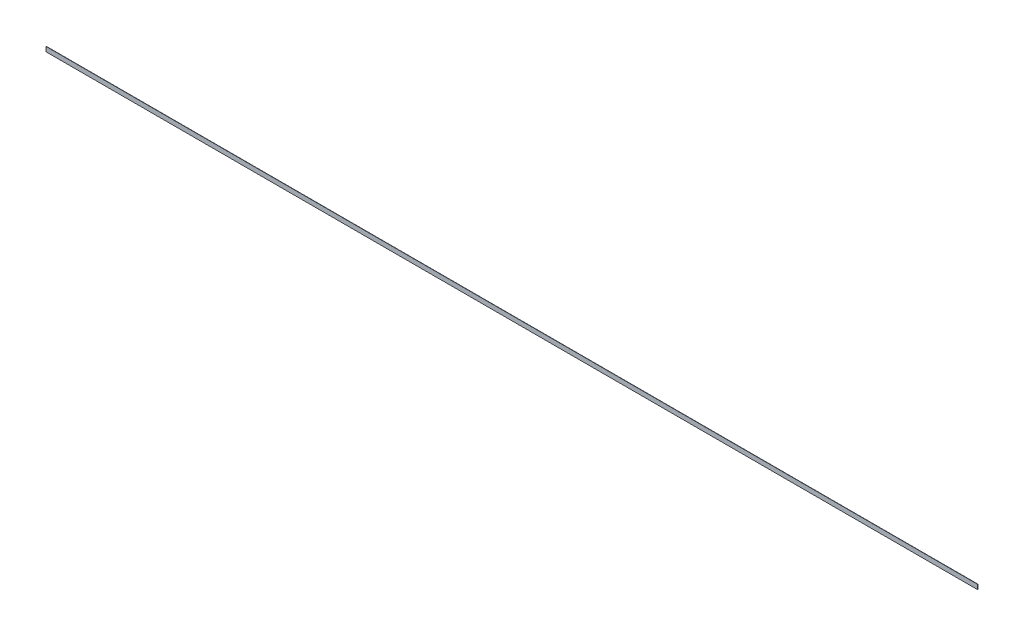
ISO-10303-21;
HEADER;
FILE_DESCRIPTION(('STEP AP214'),'2;1');
FILE_NAME('part.step','',(''),(''),'','','');
FILE_SCHEMA(('AUTOMOTIVE_DESIGN { 1 0 10303 214 1 1 1 1 }'));
ENDSEC;
DATA;
#1=APPLICATION_CONTEXT('core data for automotive mechanical design processes');
#2=APPLICATION_PROTOCOL_DEFINITION('international standard','automotive_design',2000,#1);
#3=PRODUCT_CONTEXT('',#1,'mechanical');
#4=PRODUCT('Part','Part','',(#3));
#5=PRODUCT_RELATED_PRODUCT_CATEGORY('part','',(#4));
#6=PRODUCT_DEFINITION_FORMATION('','',#4);
#7=PRODUCT_DEFINITION_CONTEXT('part definition',#1,'design');
#8=PRODUCT_DEFINITION('design','',#6,#7);
#9=PRODUCT_DEFINITION_SHAPE('','',#8);
#10=(LENGTH_UNIT() NAMED_UNIT(*) SI_UNIT(.MILLI.,.METRE.));
#11=(NAMED_UNIT(*) PLANE_ANGLE_UNIT() SI_UNIT($,.RADIAN.));
#12=(NAMED_UNIT(*) SI_UNIT($,.STERADIAN.) SOLID_ANGLE_UNIT());
#13=UNCERTAINTY_MEASURE_WITH_UNIT(LENGTH_MEASURE(1.E-05),#10,'distance_accuracy_value','');
#14=(GEOMETRIC_REPRESENTATION_CONTEXT(3) GLOBAL_UNCERTAINTY_ASSIGNED_CONTEXT((#13)) GLOBAL_UNIT_ASSIGNED_CONTEXT((#10,
#11,#12)) REPRESENTATION_CONTEXT('',''));
#15=CARTESIAN_POINT('',(0.,0.,0.));
#16=DIRECTION('',(0.,0.,1.));
#17=DIRECTION('',(1.,0.,0.));
#18=AXIS2_PLACEMENT_3D('',#15,#16,#17);
#19=CARTESIAN_POINT('',(-5080.,25.4,0.));
#20=DIRECTION('',(0.,0.,1.));
#21=DIRECTION('',(1.,0.,0.));
#22=AXIS2_PLACEMENT_3D('',#19,#20,#21);
#23=PLANE('',#22);
#24=DIRECTION('',(0.,1.,0.));
#25=VECTOR('',#24,1.);
#26=CARTESIAN_POINT('',(-5080.,0.,0.));
#27=LINE('',#26,#25);
#28=CARTESIAN_POINT('',(-5080.,25.4,0.));
#29=VERTEX_POINT('',#28);
#30=CARTESIAN_POINT('',(-5080.,-25.4,0.));
#31=VERTEX_POINT('',#30);
#32=EDGE_CURVE('E55',#29,#31,#27,.F.);
#33=ORIENTED_EDGE('',*,*,#32,.T.);
#34=DIRECTION('',(1.,0.,0.));
#35=VECTOR('',#34,1.);
#36=CARTESIAN_POINT('',(-5080.,-25.4,0.));
#37=LINE('',#36,#35);
#38=CARTESIAN_POINT('',(5080.,-25.4,0.));
#39=VERTEX_POINT('',#38);
#40=EDGE_CURVE('E67',#39,#31,#37,.F.);
#41=ORIENTED_EDGE('',*,*,#40,.F.);
#42=DIRECTION('',(0.,1.,0.));
#43=VECTOR('',#42,1.);
#44=CARTESIAN_POINT('',(5080.,0.,0.));
#45=LINE('',#44,#43);
#46=CARTESIAN_POINT('',(5080.,25.4,0.));
#47=VERTEX_POINT('',#46);
#48=EDGE_CURVE('E20',#47,#39,#45,.F.);
#49=ORIENTED_EDGE('',*,*,#48,.F.);
#50=DIRECTION('',(1.,0.,0.));
#51=VECTOR('',#50,1.);
#52=CARTESIAN_POINT('',(-5080.,25.4,0.));
#53=LINE('',#52,#51);
#54=EDGE_CURVE('E81',#29,#47,#53,.T.);
#55=ORIENTED_EDGE('',*,*,#54,.F.);
#56=EDGE_LOOP('',(#33,#41,#49,#55));
#57=FACE_BOUND('',#56,.T.);
#58=ADVANCED_FACE('F17',(#57),#23,.T.);
#59=CARTESIAN_POINT('',(5080.,0.,0.));
#60=DIRECTION('',(1.,0.,0.));
#61=DIRECTION('',(0.,0.,-1.));
#62=AXIS2_PLACEMENT_3D('',#59,#60,#61);
#63=PLANE('',#62);
#64=DIRECTION('',(0.,0.,1.));
#65=VECTOR('',#64,1.);
#66=CARTESIAN_POINT('',(5080.,25.4,-3.175));
#67=LINE('',#66,#65);
#68=CARTESIAN_POINT('',(5080.,25.4,-3.175));
#69=VERTEX_POINT('',#68);
#70=EDGE_CURVE('E65',#47,#69,#67,.F.);
#71=ORIENTED_EDGE('',*,*,#70,.F.);
#72=ORIENTED_EDGE('',*,*,#48,.T.);
#73=DIRECTION('',(0.,0.,-1.));
#74=VECTOR('',#73,1.);
#75=CARTESIAN_POINT('',(5080.,-25.4,0.));
#76=LINE('',#75,#74);
#77=CARTESIAN_POINT('',(5080.,-25.4,-3.175));
#78=VERTEX_POINT('',#77);
#79=EDGE_CURVE('E62',#78,#39,#76,.F.);
#80=ORIENTED_EDGE('',*,*,#79,.F.);
#81=DIRECTION('',(0.,1.,0.));
#82=VECTOR('',#81,1.);
#83=CARTESIAN_POINT('',(5080.,-25.4,-3.175));
#84=LINE('',#83,#82);
#85=EDGE_CURVE('E83',#69,#78,#84,.F.);
#86=ORIENTED_EDGE('',*,*,#85,.F.);
#87=EDGE_LOOP('',(#71,#72,#80,#86));
#88=FACE_BOUND('',#87,.T.);
#89=ADVANCED_FACE('F60',(#88),#63,.T.);
#90=CARTESIAN_POINT('',(-5080.,-25.4,0.));
#91=DIRECTION('',(0.,-1.,0.));
#92=DIRECTION('',(0.,0.,-1.));
#93=AXIS2_PLACEMENT_3D('',#90,#91,#92);
#94=PLANE('',#93);
#95=DIRECTION('',(0.,0.,-1.));
#96=VECTOR('',#95,1.);
#97=CARTESIAN_POINT('',(-5080.,-25.4,0.));
#98=LINE('',#97,#96);
#99=CARTESIAN_POINT('',(-5080.,-25.4,-3.175));
#100=VERTEX_POINT('',#99);
#101=EDGE_CURVE('E77',#31,#100,#98,.T.);
#102=ORIENTED_EDGE('',*,*,#101,.T.);
#103=DIRECTION('',(-1.,0.,0.));
#104=VECTOR('',#103,1.);
#105=CARTESIAN_POINT('',(-5080.,-25.4,-3.175));
#106=LINE('',#105,#104);
#107=EDGE_CURVE('E73',#78,#100,#106,.T.);
#108=ORIENTED_EDGE('',*,*,#107,.F.);
#109=ORIENTED_EDGE('',*,*,#79,.T.);
#110=ORIENTED_EDGE('',*,*,#40,.T.);
#111=EDGE_LOOP('',(#102,#108,#109,#110));
#112=FACE_BOUND('',#111,.T.);
#113=ADVANCED_FACE('F71',(#112),#94,.T.);
#114=CARTESIAN_POINT('',(-5080.,0.,0.));
#115=DIRECTION('',(1.,0.,0.));
#116=DIRECTION('',(0.,0.,-1.));
#117=AXIS2_PLACEMENT_3D('',#114,#115,#116);
#118=PLANE('',#117);
#119=ORIENTED_EDGE('',*,*,#101,.F.);
#120=ORIENTED_EDGE('',*,*,#32,.F.);
#121=DIRECTION('',(0.,0.,1.));
#122=VECTOR('',#121,1.);
#123=CARTESIAN_POINT('',(-5080.,25.4,-3.175));
#124=LINE('',#123,#122);
#125=CARTESIAN_POINT('',(-5080.,25.4,-3.175));
#126=VERTEX_POINT('',#125);
#127=EDGE_CURVE('E35',#126,#29,#124,.T.);
#128=ORIENTED_EDGE('',*,*,#127,.F.);
#129=DIRECTION('',(0.,1.,0.));
#130=VECTOR('',#129,1.);
#131=CARTESIAN_POINT('',(-5080.,-25.4,-3.175));
#132=LINE('',#131,#130);
#133=EDGE_CURVE('E26',#100,#126,#132,.T.);
#134=ORIENTED_EDGE('',*,*,#133,.F.);
#135=EDGE_LOOP('',(#119,#120,#128,#134));
#136=FACE_BOUND('',#135,.T.);
#137=ADVANCED_FACE('F89',(#136),#118,.F.);
#138=CARTESIAN_POINT('',(-5080.,25.4,-3.175));
#139=DIRECTION('',(0.,1.,0.));
#140=DIRECTION('',(0.,0.,1.));
#141=AXIS2_PLACEMENT_3D('',#138,#139,#140);
#142=PLANE('',#141);
#143=ORIENTED_EDGE('',*,*,#127,.T.);
#144=ORIENTED_EDGE('',*,*,#54,.T.);
#145=ORIENTED_EDGE('',*,*,#70,.T.);
#146=DIRECTION('',(-1.,0.,0.));
#147=VECTOR('',#146,1.);
#148=CARTESIAN_POINT('',(-5080.,25.4,-3.175));
#149=LINE('',#148,#147);
#150=EDGE_CURVE('E11',#126,#69,#149,.F.);
#151=ORIENTED_EDGE('',*,*,#150,.F.);
#152=EDGE_LOOP('',(#143,#144,#145,#151));
#153=FACE_BOUND('',#152,.T.);
#154=ADVANCED_FACE('F91',(#153),#142,.T.);
#155=CARTESIAN_POINT('',(-5080.,-25.4,-3.175));
#156=DIRECTION('',(0.,0.,-1.));
#157=DIRECTION('',(-1.,0.,0.));
#158=AXIS2_PLACEMENT_3D('',#155,#156,#157);
#159=PLANE('',#158);
#160=ORIENTED_EDGE('',*,*,#133,.T.);
#161=ORIENTED_EDGE('',*,*,#150,.T.);
#162=ORIENTED_EDGE('',*,*,#85,.T.);
#163=ORIENTED_EDGE('',*,*,#107,.T.);
#164=EDGE_LOOP('',(#160,#161,#162,#163));
#165=FACE_BOUND('',#164,.T.);
#166=ADVANCED_FACE('F88',(#165),#159,.T.);
#167=CLOSED_SHELL('',(#58,#89,#113,#137,#154,#166));
#168=MANIFOLD_SOLID_BREP('B1',#167);
#169=ADVANCED_BREP_SHAPE_REPRESENTATION('',(#18,#168),#14);
#170=SHAPE_DEFINITION_REPRESENTATION(#9,#169);
ENDSEC;
END-ISO-10303-21;
